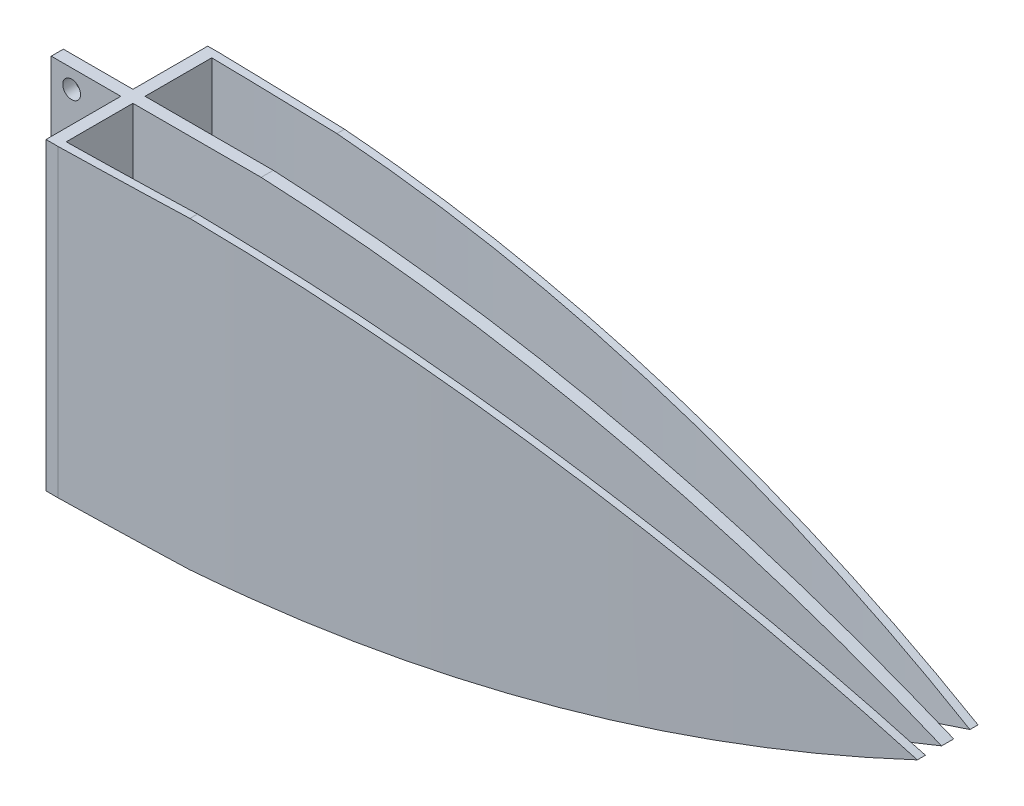
ISO-10303-21;
HEADER;
FILE_DESCRIPTION(('STEP AP214'),'2;1');
FILE_NAME('part.step','',(''),(''),'','','');
FILE_SCHEMA(('AUTOMOTIVE_DESIGN { 1 0 10303 214 1 1 1 1 }'));
ENDSEC;
DATA;
#1=APPLICATION_CONTEXT('core data for automotive mechanical design processes');
#2=APPLICATION_PROTOCOL_DEFINITION('international standard','automotive_design',2000,#1);
#3=PRODUCT_CONTEXT('',#1,'mechanical');
#4=PRODUCT('Part','Part','',(#3));
#5=PRODUCT_RELATED_PRODUCT_CATEGORY('part','',(#4));
#6=PRODUCT_DEFINITION_FORMATION('','',#4);
#7=PRODUCT_DEFINITION_CONTEXT('part definition',#1,'design');
#8=PRODUCT_DEFINITION('design','',#6,#7);
#9=PRODUCT_DEFINITION_SHAPE('','',#8);
#10=(LENGTH_UNIT() NAMED_UNIT(*) SI_UNIT(.MILLI.,.METRE.));
#11=(NAMED_UNIT(*) PLANE_ANGLE_UNIT() SI_UNIT($,.RADIAN.));
#12=(NAMED_UNIT(*) SI_UNIT($,.STERADIAN.) SOLID_ANGLE_UNIT());
#13=UNCERTAINTY_MEASURE_WITH_UNIT(LENGTH_MEASURE(1.E-05),#10,'distance_accuracy_value','');
#14=(GEOMETRIC_REPRESENTATION_CONTEXT(3) GLOBAL_UNCERTAINTY_ASSIGNED_CONTEXT((#13)) GLOBAL_UNIT_ASSIGNED_CONTEXT((#10,
#11,#12)) REPRESENTATION_CONTEXT('',''));
#15=CARTESIAN_POINT('',(0.,0.,0.));
#16=DIRECTION('',(0.,0.,1.));
#17=DIRECTION('',(1.,0.,0.));
#18=AXIS2_PLACEMENT_3D('',#15,#16,#17);
#19=CARTESIAN_POINT('',(-17.2852084932397,-18.2647657841141,-1086.68833589183));
#20=DIRECTION('',(0.,1.,0.));
#21=DIRECTION('',(-1.,0.,0.));
#22=AXIS2_PLACEMENT_3D('',#19,#20,#21);
#23=CYLINDRICAL_SURFACE('',#22,1095.84090006673);
#24=CARTESIAN_POINT('',(13.103688800574,-18.2380913098096,8.73112403222787));
#25=CARTESIAN_POINT('',(14.9986741159179,-18.1821595298657,8.67855571875341));
#26=CARTESIAN_POINT('',(16.8928070961871,-18.104431262455,8.6210855583314));
#27=CARTESIAN_POINT('',(20.6784628465838,-17.9054482740115,8.49640837568931));
#28=CARTESIAN_POINT('',(22.5699856191637,-17.7841935939041,8.42920136262424));
#29=CARTESIAN_POINT('',(28.2389529228422,-17.3552646728917,8.21308781497228));
#30=CARTESIAN_POINT('',(32.0111304158066,-16.9824156790888,8.04967949234752));
#31=CARTESIAN_POINT('',(39.5001416334272,-16.0679334220321,7.68666300479193));
#32=CARTESIAN_POINT('',(43.2171725545415,-15.5277750081056,7.48737729315888));
#33=CARTESIAN_POINT('',(50.6207551394182,-14.2791054574376,7.05286206323423));
#34=CARTESIAN_POINT('',(54.3073068812434,-13.5705947520147,6.817632637031));
#35=CARTESIAN_POINT('',(61.6419552564059,-11.9870546062361,6.31271345795367));
#36=CARTESIAN_POINT('',(65.290053111482,-11.1120304731986,6.04302480349593));
#37=CARTESIAN_POINT('',(72.5402577307319,-9.19763453953254,5.4709418843329));
#38=CARTESIAN_POINT('',(76.1423640874289,-8.15826128388963,5.16854733008348));
#39=CARTESIAN_POINT('',(83.3242254734376,-5.90791883093385,4.5303073083697));
#40=CARTESIAN_POINT('',(86.9035170827257,-4.69554207711856,4.19419492902983));
#41=CARTESIAN_POINT('',(92.2258030985259,-2.75578306800186,3.66839327245229));
#42=CARTESIAN_POINT('',(93.9921713815322,-2.0889776463933,3.48951529583038));
#43=CARTESIAN_POINT('',(97.5085473383613,-0.715332669655094,3.12485754354286));
#44=CARTESIAN_POINT('',(99.258555061766,-0.00849323589739606,2.93907778880211));
#45=CARTESIAN_POINT('',(101.,0.718187038830978,2.74999999999979));
#46=B_SPLINE_CURVE_WITH_KNOTS('',3,(#24,#25,#26,#27,#28,#29,#30,#31,#32,#33,#34,#35,#36,#37,#38,
#39,#40,#41,#42,#43,#44,#45),.UNSPECIFIED.,.F.,.F.,(4,2,2,2,2,2,2,2,2,2,4),(0.,5.6893405528307,
11.3786757563252,22.7563444181236,34.0364425308723,45.3165117443128,56.5962214858857,
67.8760310944907,79.2534859656059,84.942527898806,90.6315525853426),.UNSPECIFIED.);
#47=CARTESIAN_POINT('',(16.7923479325538,-18.1016450332281,8.62257814449768));
#48=VERTEX_POINT('',#47);
#49=CARTESIAN_POINT('',(101.,0.718187038831003,2.74999999999981));
#50=VERTEX_POINT('',#49);
#51=EDGE_CURVE('E325',#48,#50,#46,.T.);
#52=ORIENTED_EDGE('',*,*,#51,.F.);
#53=CARTESIAN_POINT('',(-17.2852084932397,-18.1016450332279,-1086.68833589183));
#54=DIRECTION('',(0.,-1.,0.));
#55=DIRECTION('',(0.,0.,-1.));
#56=AXIS2_PLACEMENT_3D('',#53,#54,#55);
#57=CIRCLE('',#56,1095.84090006673);
#58=CARTESIAN_POINT('',(1.,-18.1016450332281,8.9999999999999));
#59=VERTEX_POINT('',#58);
#60=EDGE_CURVE('E53',#48,#59,#57,.T.);
#61=ORIENTED_EDGE('',*,*,#60,.T.);
#62=DIRECTION('',(0.,1.,0.));
#63=VECTOR('',#62,1.);
#64=CARTESIAN_POINT('',(1.00000000000001,-18.264765784114,9.));
#65=LINE('',#64,#63);
#66=CARTESIAN_POINT('',(1.,19.535234215886,9.));
#67=VERTEX_POINT('',#66);
#68=EDGE_CURVE('E340',#59,#67,#65,.T.);
#69=ORIENTED_EDGE('',*,*,#68,.T.);
#70=CARTESIAN_POINT('',(-17.2852084932397,19.5352342158859,-1086.68833589183));
#71=DIRECTION('',(0.,1.,0.));
#72=DIRECTION('',(-1.,0.,0.));
#73=AXIS2_PLACEMENT_3D('',#70,#71,#72);
#74=CIRCLE('',#73,1095.84090006673);
#75=CARTESIAN_POINT('',(16.8547942960303,19.535234215886,8.6206335175314));
#76=VERTEX_POINT('',#75);
#77=EDGE_CURVE('E252',#67,#76,#74,.T.);
#78=ORIENTED_EDGE('',*,*,#77,.T.);
#79=CARTESIAN_POINT('',(101.,0.718187038831114,2.74999999999981));
#80=CARTESIAN_POINT('',(99.2585550617661,1.44486731355951,2.93907778880233));
#81=CARTESIAN_POINT('',(97.5085473383614,2.15170674731721,3.12485754354307));
#82=CARTESIAN_POINT('',(93.9921713815323,3.52535172405541,3.48951529583042));
#83=CARTESIAN_POINT('',(92.2258030985259,4.19215714566396,3.66839327245217));
#84=CARTESIAN_POINT('',(86.9035170827257,6.13191615478065,4.19419492902944));
#85=CARTESIAN_POINT('',(83.3242254734376,7.34429290859596,4.53030730836937));
#86=CARTESIAN_POINT('',(76.1423640874289,9.59463536155176,5.16854733008339));
#87=CARTESIAN_POINT('',(72.5402577307319,10.6340086171947,5.47094188433297));
#88=CARTESIAN_POINT('',(65.290053111482,12.5484045508607,6.0430248034961));
#89=CARTESIAN_POINT('',(61.6419552564059,13.4234286838981,6.31271345795376));
#90=CARTESIAN_POINT('',(54.3073068812433,15.0069688296768,6.81763263703093));
#91=CARTESIAN_POINT('',(50.6207551394182,15.7154795350997,7.05286206323405));
#92=CARTESIAN_POINT('',(43.2171725545414,16.9641490857678,7.48737729315868));
#93=CARTESIAN_POINT('',(39.5001416334271,17.5043074996942,7.6866630047918));
#94=CARTESIAN_POINT('',(32.0111304158065,18.4187897567509,8.04967949234764));
#95=CARTESIAN_POINT('',(28.2389529228421,18.7916387505538,8.21308781497258));
#96=CARTESIAN_POINT('',(22.5699856191637,19.2205676715662,8.42920136262438));
#97=CARTESIAN_POINT('',(20.6784628465837,19.3418223516736,8.49640837568933));
#98=CARTESIAN_POINT('',(16.892807096187,19.5408053401171,8.62108555833128));
#99=CARTESIAN_POINT('',(14.9986741159178,19.6185336075278,8.67855571875326));
#100=CARTESIAN_POINT('',(13.1036888005739,19.6744653874718,8.73112403222786));
#101=B_SPLINE_CURVE_WITH_KNOTS('',3,(#79,#80,#81,#82,#83,#84,#85,#86,#87,#88,#89,#90,#91,#92,
#93,#94,#95,#96,#97,#98,#99,#100),.UNSPECIFIED.,.F.,.F.,(4,2,2,2,2,2,2,2,2,2,4),(0.,
5.68902468653662,11.3780666197367,22.755521490852,34.0353310994569,45.3150408410299,
56.5951100544705,67.8752081672192,79.2528768290175,84.9422120325121,90.6315525853428),.UNSPECIFIED.);
#102=EDGE_CURVE('E300',#50,#76,#101,.T.);
#103=ORIENTED_EDGE('',*,*,#102,.F.);
#104=EDGE_LOOP('',(#52,#61,#69,#78,#103));
#105=FACE_BOUND('',#104,.T.);
#106=ADVANCED_FACE('F38',(#105),#23,.F.);
#107=CARTESIAN_POINT('',(-25.1770830974539,-18.2647657841141,-1211.95832955926));
#108=DIRECTION('',(0.,1.,0.));
#109=DIRECTION('',(-1.,0.,0.));
#110=AXIS2_PLACEMENT_3D('',#107,#108,#109);
#111=CYLINDRICAL_SURFACE('',#110,1222.23868326066);
#112=DIRECTION('',(0.,-1.,0.));
#113=VECTOR('',#112,1.);
#114=CARTESIAN_POINT('',(1.,19.735234215886,10.));
#115=LINE('',#114,#113);
#116=CARTESIAN_POINT('',(1.,19.535234215886,10.));
#117=VERTEX_POINT('',#116);
#118=CARTESIAN_POINT('',(1.,-18.1016450332281,9.99999999999999));
#119=VERTEX_POINT('',#118);
#120=EDGE_CURVE('E363',#117,#119,#115,.T.);
#121=ORIENTED_EDGE('',*,*,#120,.T.);
#122=CARTESIAN_POINT('',(-25.1770830974539,-18.1016450332279,-1211.95832955926));
#123=DIRECTION('',(0.,-1.,0.));
#124=DIRECTION('',(0.,0.,-1.));
#125=AXIS2_PLACEMENT_3D('',#122,#123,#124);
#126=CIRCLE('',#125,1222.23868326066);
#127=CARTESIAN_POINT('',(16.7923479325538,-18.1016450332281,9.55956458628426));
#128=VERTEX_POINT('',#127);
#129=EDGE_CURVE('E399',#119,#128,#126,.F.);
#130=ORIENTED_EDGE('',*,*,#129,.T.);
#131=CARTESIAN_POINT('',(101.,0.718187038831058,3.74999999999992));
#132=CARTESIAN_POINT('',(99.258003019389,-0.00872359932098572,3.93080120117452));
#133=CARTESIAN_POINT('',(97.507486229986,-0.71576062039269,4.10869942642488));
#134=CARTESIAN_POINT('',(93.990180967723,-2.08974173621458,4.45841038746494));
#135=CARTESIAN_POINT('',(92.2233924532046,-2.75668572828718,4.63022310766929));
#136=CARTESIAN_POINT('',(86.899990629276,-4.69677912966614,5.13609276355491));
#137=CARTESIAN_POINT('',(83.3201386873285,-5.90927440835207,5.46060224289145));
#138=CARTESIAN_POINT('',(76.1372654081746,-8.15978439048723,6.0793080170652));
#139=CARTESIAN_POINT('',(72.5347008550286,-9.19919677168643,6.37373888197213));
#140=CARTESIAN_POINT('',(65.2838916358919,-11.1135622899455,6.93355730676975));
#141=CARTESIAN_POINT('',(61.6356473296942,-11.9885167214772,7.19894509525575));
#142=CARTESIAN_POINT('',(54.3009988799346,-13.571856222557,7.69905892584603));
#143=CARTESIAN_POINT('',(50.6145937080462,-14.2802367911514,7.93378413934783));
#144=CARTESIAN_POINT('',(43.2115237647445,-15.5286354051633,8.37119447025042));
#145=CARTESIAN_POINT('',(39.494858916655,-16.068653023823,8.57387950643676));
#146=CARTESIAN_POINT('',(32.0069914904187,-16.982845824652,8.94770709060366));
#147=CARTESIAN_POINT('',(28.2355946007829,-17.3555580452391,9.11856402722967));
#148=CARTESIAN_POINT('',(22.5678553522702,-17.784335113017,9.34891986239949));
#149=CARTESIAN_POINT('',(20.6767535886379,-17.9055479967174,9.42138609850683));
#150=CARTESIAN_POINT('',(16.891948427009,-18.1044665100688,9.55760639820794));
#151=CARTESIAN_POINT('',(14.9982450268907,-18.1821721042153,9.62136045469202));
#152=CARTESIAN_POINT('',(13.1036888005739,-18.2380913098096,9.68072571101025));
#153=B_SPLINE_CURVE_WITH_KNOTS('',3,(#131,#132,#133,#134,#135,#136,#137,#138,#139,#140,#141,
#142,#143,#144,#145,#146,#147,#148,#149,#150,#151,#152),.UNSPECIFIED.,.F.,.F.,(4,2,2,2,2,2,2,2,
2,2,4),(0.,5.68838999298516,11.3767945532229,22.7529434902618,34.0322328094434,45.3114333440195,
56.5909386162426,67.8704724789469,79.2468027345779,84.9354560007952,90.6241139092895),.UNSPECIFIED.);
#154=CARTESIAN_POINT('',(101.,0.718187038831003,3.7499999999997));
#155=VERTEX_POINT('',#154);
#156=EDGE_CURVE('E317',#155,#128,#153,.T.);
#157=ORIENTED_EDGE('',*,*,#156,.F.);
#158=CARTESIAN_POINT('',(13.1036888005739,19.6744653874718,9.68072571101031));
#159=CARTESIAN_POINT('',(14.9982450268906,19.6185461818774,9.62136045469184));
#160=CARTESIAN_POINT('',(16.891948427009,19.5408405877309,9.55760639820773));
#161=CARTESIAN_POINT('',(20.6767535886378,19.3419220743795,9.4213860985067));
#162=CARTESIAN_POINT('',(22.5678553522702,19.2207091906791,9.34891986239947));
#163=CARTESIAN_POINT('',(28.2355946007828,18.7919321229012,9.11856402722984));
#164=CARTESIAN_POINT('',(32.0069914904186,18.4192199023141,8.94770709060374));
#165=CARTESIAN_POINT('',(39.494858916655,17.5050271014851,8.57387950643675));
#166=CARTESIAN_POINT('',(43.2115237647444,16.9650094828254,8.37119447025044));
#167=CARTESIAN_POINT('',(50.6145937080461,15.7166108688135,7.93378413934786));
#168=CARTESIAN_POINT('',(54.3009988799345,15.0082303002191,7.69905892584604));
#169=CARTESIAN_POINT('',(61.6356473296941,13.4248907991393,7.19894509525575));
#170=CARTESIAN_POINT('',(65.2838916358918,12.5499363676076,6.93355730676975));
#171=CARTESIAN_POINT('',(72.5347008550285,10.6355708493486,6.37373888197212));
#172=CARTESIAN_POINT('',(76.1372654081745,9.59615846814937,6.07930801706518));
#173=CARTESIAN_POINT('',(83.3201386873284,7.34564848601421,5.46060224289142));
#174=CARTESIAN_POINT('',(86.8999906292759,6.13315320732831,5.13609276355489));
#175=CARTESIAN_POINT('',(92.2233924532045,4.19305980594936,4.63022310766926));
#176=CARTESIAN_POINT('',(93.9901809677229,3.52611581387676,4.4584103874649));
#177=CARTESIAN_POINT('',(97.5074862299859,2.15213469805488,4.10869942642484));
#178=CARTESIAN_POINT('',(99.2580030193888,1.44509767698317,3.93080120117448));
#179=CARTESIAN_POINT('',(101.,0.718187038831122,3.74999999999987));
#180=B_SPLINE_CURVE_WITH_KNOTS('',3,(#158,#159,#160,#161,#162,#163,#164,#165,#166,#167,#168,
#169,#170,#171,#172,#173,#174,#175,#176,#177,#178,#179),.UNSPECIFIED.,.F.,.F.,(4,2,2,2,2,2,2,2,
2,2,4),(0.,5.68865790849438,11.3773111747117,22.7536414303427,34.0331752930469,45.31268056527,
56.5918810998461,67.8711704190277,79.2473193560666,84.9357239163043,90.6241139092895),.UNSPECIFIED.);
#181=CARTESIAN_POINT('',(16.854794296037,19.535234215886,9.55741742950722));
#182=VERTEX_POINT('',#181);
#183=EDGE_CURVE('E294',#182,#155,#180,.T.);
#184=ORIENTED_EDGE('',*,*,#183,.F.);
#185=CARTESIAN_POINT('',(-25.1770830974539,19.5352342158859,-1211.95832955926));
#186=DIRECTION('',(0.,1.,0.));
#187=DIRECTION('',(-1.,0.,0.));
#188=AXIS2_PLACEMENT_3D('',#185,#186,#187);
#189=CIRCLE('',#188,1222.23868326066);
#190=EDGE_CURVE('E257',#182,#117,#189,.F.);
#191=ORIENTED_EDGE('',*,*,#190,.T.);
#192=EDGE_LOOP('',(#121,#130,#157,#184,#191));
#193=FACE_BOUND('',#192,.T.);
#194=ADVANCED_FACE('F307',(#193),#111,.T.);
#195=CARTESIAN_POINT('',(-17.2852084932396,-18.2647657841141,1086.68833589183));
#196=DIRECTION('',(0.,1.,0.));
#197=DIRECTION('',(-1.,0.,0.));
#198=AXIS2_PLACEMENT_3D('',#195,#196,#197);
#199=CYLINDRICAL_SURFACE('',#198,1095.84090006673);
#200=DIRECTION('',(0.,1.,0.));
#201=VECTOR('',#200,1.);
#202=CARTESIAN_POINT('',(1.00000000000001,-18.264765784114,-9.));
#203=LINE('',#202,#201);
#204=CARTESIAN_POINT('',(1.,-18.1016450332281,-8.99999999999995));
#205=VERTEX_POINT('',#204);
#206=CARTESIAN_POINT('',(1.00000000000001,19.535234215886,-8.9999999999999));
#207=VERTEX_POINT('',#206);
#208=EDGE_CURVE('E338',#205,#207,#203,.T.);
#209=ORIENTED_EDGE('',*,*,#208,.F.);
#210=CARTESIAN_POINT('',(-17.2852084932396,-18.1016450332283,1086.68833589183));
#211=DIRECTION('',(0.,-1.,0.));
#212=DIRECTION('',(0.,0.,-1.));
#213=AXIS2_PLACEMENT_3D('',#210,#211,#212);
#214=CIRCLE('',#213,1095.84090006673);
#215=CARTESIAN_POINT('',(16.7923479325544,-18.1016450332281,-8.62257814449752));
#216=VERTEX_POINT('',#215);
#217=EDGE_CURVE('E454',#205,#216,#214,.T.);
#218=ORIENTED_EDGE('',*,*,#217,.T.);
#219=CARTESIAN_POINT('',(101.,0.718187038831086,-2.74999999999981));
#220=CARTESIAN_POINT('',(99.2585550617663,-0.00849323589727626,-2.93907778880233));
#221=CARTESIAN_POINT('',(97.5085473383616,-0.715332669654972,-3.12485754354308));
#222=CARTESIAN_POINT('',(93.9921713815325,-2.08897764639318,-3.48951529583042));
#223=CARTESIAN_POINT('',(92.2258030985262,-2.75578306800174,-3.66839327245218));
#224=CARTESIAN_POINT('',(86.9035170827259,-4.69554207711846,-4.19419492902944));
#225=CARTESIAN_POINT('',(83.3242254734378,-5.90791883093376,-4.53030730836938));
#226=CARTESIAN_POINT('',(76.1423640874291,-8.15826128388957,-5.1685473300834));
#227=CARTESIAN_POINT('',(72.5402577307321,-9.1976345395325,-5.47094188433299));
#228=CARTESIAN_POINT('',(65.2900531114822,-11.1120304731985,-6.04302480349611));
#229=CARTESIAN_POINT('',(61.641955256406,-11.987054606236,-6.31271345795378));
#230=CARTESIAN_POINT('',(54.3073068812435,-13.5705947520146,-6.81763263703094));
#231=CARTESIAN_POINT('',(50.6207551394183,-14.2791054574375,-7.05286206323407));
#232=CARTESIAN_POINT('',(43.2171725545415,-15.5277750081056,-7.4873772931587));
#233=CARTESIAN_POINT('',(39.5001416334273,-16.0679334220321,-7.68666300479182));
#234=CARTESIAN_POINT('',(32.0111304158067,-16.9824156790888,-8.04967949234766));
#235=CARTESIAN_POINT('',(28.2389529228423,-17.3552646728917,-8.2130878149726));
#236=CARTESIAN_POINT('',(22.5699856191638,-17.7841935939041,-8.42920136262441));
#237=CARTESIAN_POINT('',(20.6784628465838,-17.9054482740115,-8.49640837568935));
#238=CARTESIAN_POINT('',(16.8928070961871,-18.1044312624549,-8.6210855583313));
#239=CARTESIAN_POINT('',(14.9986741159179,-18.1821595298657,-8.67855571875329));
#240=CARTESIAN_POINT('',(13.103688800574,-18.2380913098097,-8.73112403222789));
#241=B_SPLINE_CURVE_WITH_KNOTS('',3,(#219,#220,#221,#222,#223,#224,#225,#226,#227,#228,#229,
#230,#231,#232,#233,#234,#235,#236,#237,#238,#239,#240),.UNSPECIFIED.,.F.,.F.,(4,2,2,2,2,2,2,2,
2,2,4),(0.,5.68902468653664,11.3780666197367,22.755521490852,34.035331099457,45.31504084103,
56.5951100544706,67.8752081672192,79.2528768290176,84.9422120325122,90.6315525853429),.UNSPECIFIED.);
#242=CARTESIAN_POINT('',(101.,0.718187038831003,-2.75));
#243=VERTEX_POINT('',#242);
#244=EDGE_CURVE('E326',#243,#216,#241,.T.);
#245=ORIENTED_EDGE('',*,*,#244,.F.);
#246=CARTESIAN_POINT('',(13.1036888005739,19.6744653874718,-8.73112403222787));
#247=CARTESIAN_POINT('',(14.9986741159178,19.6185336075278,-8.67855571875326));
#248=CARTESIAN_POINT('',(16.892807096187,19.5408053401171,-8.62108555833127));
#249=CARTESIAN_POINT('',(20.6784628465837,19.3418223516736,-8.49640837568932));
#250=CARTESIAN_POINT('',(22.5699856191637,19.2205676715662,-8.42920136262438));
#251=CARTESIAN_POINT('',(28.2389529228422,18.7916387505538,-8.21308781497258));
#252=CARTESIAN_POINT('',(32.0111304158066,18.4187897567509,-8.04967949234764));
#253=CARTESIAN_POINT('',(39.5001416334271,17.5043074996943,-7.6866630047918));
#254=CARTESIAN_POINT('',(43.2171725545414,16.9641490857678,-7.48737729315867));
#255=CARTESIAN_POINT('',(50.6207551394182,15.7154795350997,-7.05286206323405));
#256=CARTESIAN_POINT('',(54.3073068812434,15.0069688296768,-6.81763263703092));
#257=CARTESIAN_POINT('',(61.6419552564059,13.4234286838982,-6.31271345795376));
#258=CARTESIAN_POINT('',(65.290053111482,12.5484045508607,-6.04302480349609));
#259=CARTESIAN_POINT('',(72.5402577307319,10.6340086171947,-5.47094188433297));
#260=CARTESIAN_POINT('',(76.1423640874289,9.59463536155178,-5.16854733008338));
#261=CARTESIAN_POINT('',(83.3242254734376,7.34429290859598,-4.53030730836936));
#262=CARTESIAN_POINT('',(86.9035170827257,6.13191615478065,-4.19419492902943));
#263=CARTESIAN_POINT('',(92.225803098526,4.19215714566394,-3.66839327245216));
#264=CARTESIAN_POINT('',(93.9921713815323,3.52535172405539,-3.48951529583041));
#265=CARTESIAN_POINT('',(97.5085473383614,2.1517067473172,-3.12485754354306));
#266=CARTESIAN_POINT('',(99.2585550617661,1.44486731355951,-2.93907778880232));
#267=CARTESIAN_POINT('',(101.,0.718187038831127,-2.74999999999979));
#268=B_SPLINE_CURVE_WITH_KNOTS('',3,(#246,#247,#248,#249,#250,#251,#252,#253,#254,#255,#256,
#257,#258,#259,#260,#261,#262,#263,#264,#265,#266,#267),.UNSPECIFIED.,.F.,.F.,(4,2,2,2,2,2,2,2,
2,2,4),(0.,5.68934055283071,11.3786757563253,22.7563444181236,34.0364425308723,45.3165117443128,
56.5962214858858,67.8760310944908,79.2534859656061,84.9425278988062,90.6315525853428),.UNSPECIFIED.);
#269=CARTESIAN_POINT('',(16.854794296037,19.5352342158859,-8.62063351753113));
#270=VERTEX_POINT('',#269);
#271=EDGE_CURVE('E269',#270,#243,#268,.T.);
#272=ORIENTED_EDGE('',*,*,#271,.F.);
#273=CARTESIAN_POINT('',(-17.2852084932397,19.5352342158859,1086.68833589183));
#274=DIRECTION('',(0.,1.,0.));
#275=DIRECTION('',(-1.,0.,0.));
#276=AXIS2_PLACEMENT_3D('',#273,#274,#275);
#277=CIRCLE('',#276,1095.84090006673);
#278=EDGE_CURVE('E61',#270,#207,#277,.T.);
#279=ORIENTED_EDGE('',*,*,#278,.T.);
#280=EDGE_LOOP('',(#209,#218,#245,#272,#279));
#281=FACE_BOUND('',#280,.T.);
#282=ADVANCED_FACE('F310',(#281),#199,.F.);
#283=CARTESIAN_POINT('',(-25.1770830974539,-18.2647657841141,1211.95832955926));
#284=DIRECTION('',(0.,1.,0.));
#285=DIRECTION('',(-1.,0.,0.));
#286=AXIS2_PLACEMENT_3D('',#283,#284,#285);
#287=CYLINDRICAL_SURFACE('',#286,1222.23868326066);
#288=CARTESIAN_POINT('',(13.103688800574,-18.2380913098096,-9.68072571101031));
#289=CARTESIAN_POINT('',(14.9982450268907,-18.1821721042153,-9.62136045469184));
#290=CARTESIAN_POINT('',(16.891948427009,-18.1044665100688,-9.55760639820773));
#291=CARTESIAN_POINT('',(20.6767535886379,-17.9055479967174,-9.4213860985067));
#292=CARTESIAN_POINT('',(22.5678553522702,-17.784335113017,-9.34891986239947));
#293=CARTESIAN_POINT('',(28.2355946007829,-17.3555580452391,-9.11856402722984));
#294=CARTESIAN_POINT('',(32.0069914904186,-16.982845824652,-8.94770709060374));
#295=CARTESIAN_POINT('',(39.494858916655,-16.068653023823,-8.57387950643675));
#296=CARTESIAN_POINT('',(43.2115237647445,-15.5286354051633,-8.37119447025043));
#297=CARTESIAN_POINT('',(50.6145937080462,-14.2802367911514,-7.93378413934785));
#298=CARTESIAN_POINT('',(54.3009988799346,-13.5718562225569,-7.69905892584604));
#299=CARTESIAN_POINT('',(61.6356473296941,-11.9885167214772,-7.19894509525575));
#300=CARTESIAN_POINT('',(65.2838916358919,-11.1135622899455,-6.93355730676975));
#301=CARTESIAN_POINT('',(72.5347008550286,-9.19919677168648,-6.37373888197211));
#302=CARTESIAN_POINT('',(76.1372654081746,-8.15978439048728,-6.07930801706518));
#303=CARTESIAN_POINT('',(83.3201386873285,-5.90927440835208,-5.46060224289142));
#304=CARTESIAN_POINT('',(86.8999906292759,-4.69677912966613,-5.13609276355488));
#305=CARTESIAN_POINT('',(92.2233924532045,-2.75668572828721,-4.63022310766925));
#306=CARTESIAN_POINT('',(93.9901809677229,-2.08974173621464,-4.4584103874649));
#307=CARTESIAN_POINT('',(97.507486229986,-0.715760620392782,-4.10869942642483));
#308=CARTESIAN_POINT('',(99.2580030193889,-0.00872359932107549,-3.93080120117447));
#309=CARTESIAN_POINT('',(101.,0.718187038831019,-3.74999999999987));
#310=B_SPLINE_CURVE_WITH_KNOTS('',3,(#288,#289,#290,#291,#292,#293,#294,#295,#296,#297,#298,
#299,#300,#301,#302,#303,#304,#305,#306,#307,#308,#309),.UNSPECIFIED.,.F.,.F.,(4,2,2,2,2,2,2,2,
2,2,4),(0.,5.68865790849438,11.3773111747116,22.7536414303426,34.0331752930469,45.31268056527,
56.5918810998461,67.8711704190276,79.2473193560665,84.9357239163043,90.6241139092894),.UNSPECIFIED.);
#311=CARTESIAN_POINT('',(16.7923479325538,-18.1016450332281,-9.55956458628426));
#312=VERTEX_POINT('',#311);
#313=CARTESIAN_POINT('',(101.,0.718187038831003,-3.7499999999997));
#314=VERTEX_POINT('',#313);
#315=EDGE_CURVE('E413',#312,#314,#310,.T.);
#316=ORIENTED_EDGE('',*,*,#315,.F.);
#317=CARTESIAN_POINT('',(-25.1770830974539,-18.1016450332283,1211.95832955926));
#318=DIRECTION('',(0.,-1.,0.));
#319=DIRECTION('',(0.,0.,-1.));
#320=AXIS2_PLACEMENT_3D('',#317,#318,#319);
#321=CIRCLE('',#320,1222.23868326066);
#322=CARTESIAN_POINT('',(0.99999999999989,-18.1016450332281,-9.99999999999979));
#323=VERTEX_POINT('',#322);
#324=EDGE_CURVE('E448',#312,#323,#321,.F.);
#325=ORIENTED_EDGE('',*,*,#324,.T.);
#326=DIRECTION('',(0.,1.,0.));
#327=VECTOR('',#326,1.);
#328=CARTESIAN_POINT('',(0.999999999999795,-18.264765784114,-9.99999999999979));
#329=LINE('',#328,#327);
#330=CARTESIAN_POINT('',(0.999999999999789,19.535234215886,-9.99999999999979));
#331=VERTEX_POINT('',#330);
#332=EDGE_CURVE('E337',#323,#331,#329,.T.);
#333=ORIENTED_EDGE('',*,*,#332,.T.);
#334=CARTESIAN_POINT('',(-25.1770830974539,19.5352342158859,1211.95832955926));
#335=DIRECTION('',(0.,1.,0.));
#336=DIRECTION('',(-1.,0.,0.));
#337=AXIS2_PLACEMENT_3D('',#334,#335,#336);
#338=CIRCLE('',#337,1222.23868326066);
#339=CARTESIAN_POINT('',(16.854794296037,19.535234215886,-9.55741742950722));
#340=VERTEX_POINT('',#339);
#341=EDGE_CURVE('E221',#331,#340,#338,.F.);
#342=ORIENTED_EDGE('',*,*,#341,.T.);
#343=CARTESIAN_POINT('',(101.,0.718187038831114,-3.7499999999997));
#344=CARTESIAN_POINT('',(99.2580030193889,1.44509767698317,-3.93080120117444));
#345=CARTESIAN_POINT('',(97.5074862299859,2.15213469805488,-4.10869942642482));
#346=CARTESIAN_POINT('',(93.9901809677229,3.52611581387677,-4.45841038746483));
#347=CARTESIAN_POINT('',(92.2233924532045,4.19305980594937,-4.63022310766912));
#348=CARTESIAN_POINT('',(86.8999906292759,6.13315320732832,-5.13609276355475));
#349=CARTESIAN_POINT('',(83.3201386873285,7.34564848601421,-5.46060224289155));
#350=CARTESIAN_POINT('',(76.1372654081745,9.59615846814937,-6.07930801706531));
#351=CARTESIAN_POINT('',(72.5347008550285,10.6355708493486,-6.37373888197199));
#352=CARTESIAN_POINT('',(65.2838916358918,12.5499363676076,-6.93355730676953));
#353=CARTESIAN_POINT('',(61.6356473296941,13.4248907991393,-7.19894509525569));
#354=CARTESIAN_POINT('',(54.3009988799345,15.0082303002191,-7.69905892584608));
#355=CARTESIAN_POINT('',(50.6145937080461,15.7166108688135,-7.93378413934783));
#356=CARTESIAN_POINT('',(43.2115237647444,16.9650094828254,-8.37119447025045));
#357=CARTESIAN_POINT('',(39.494858916655,17.5050271014851,-8.57387950643687));
#358=CARTESIAN_POINT('',(32.0069914904186,18.4192199023141,-8.94770709060376));
#359=CARTESIAN_POINT('',(28.2355946007829,18.7919321229012,-9.11856402722966));
#360=CARTESIAN_POINT('',(22.5678553522702,19.2207091906791,-9.34891986239943));
#361=CARTESIAN_POINT('',(20.6767535886379,19.3419220743795,-9.42138609850677));
#362=CARTESIAN_POINT('',(16.891948427009,19.5408405877309,-9.55760639820795));
#363=CARTESIAN_POINT('',(14.9982450268906,19.6185461818774,-9.62136045469209));
#364=CARTESIAN_POINT('',(13.1036888005739,19.6744653874718,-9.68072571101045));
#365=B_SPLINE_CURVE_WITH_KNOTS('',3,(#343,#344,#345,#346,#347,#348,#349,#350,#351,#352,#353,
#354,#355,#356,#357,#358,#359,#360,#361,#362,#363,#364),.UNSPECIFIED.,.F.,.F.,(4,2,2,2,2,2,2,2,
2,2,4),(0.,5.68838999298517,11.3767945532229,22.7529434902618,34.0322328094434,45.3114333440195,
56.5909386162425,67.8704724789468,79.2468027345778,84.9354560007951,90.6241139092894),.UNSPECIFIED.);
#366=EDGE_CURVE('E260',#314,#340,#365,.T.);
#367=ORIENTED_EDGE('',*,*,#366,.F.);
#368=EDGE_LOOP('',(#316,#325,#333,#342,#367));
#369=FACE_BOUND('',#368,.T.);
#370=ADVANCED_FACE('F276',(#369),#287,.T.);
#371=CARTESIAN_POINT('',(0.,0.,-0.75));
#372=DIRECTION('',(0.,0.,1.));
#373=DIRECTION('',(1.,0.,0.));
#374=AXIS2_PLACEMENT_3D('',#371,#372,#373);
#375=PLANE('',#374);
#376=CARTESIAN_POINT('',(-6.60183299389003,-15.7647657841141,-0.75));
#377=DIRECTION('',(0.,0.,1.));
#378=DIRECTION('',(1.,0.,0.));
#379=AXIS2_PLACEMENT_3D('',#376,#377,#378);
#380=CIRCLE('',#379,1.1);
#381=CARTESIAN_POINT('',(-5.50183299389003,-15.7647657841141,-0.75));
#382=VERTEX_POINT('',#381);
#383=EDGE_CURVE('E384',#382,#382,#380,.T.);
#384=ORIENTED_EDGE('',*,*,#383,.T.);
#385=EDGE_LOOP('',(#384));
#386=FACE_BOUND('',#385,.T.);
#387=CARTESIAN_POINT('',(-6.57841140529532,17.2352342158859,-0.75));
#388=DIRECTION('',(0.,0.,1.));
#389=DIRECTION('',(1.,0.,0.));
#390=AXIS2_PLACEMENT_3D('',#387,#388,#389);
#391=CIRCLE('',#390,1.1);
#392=CARTESIAN_POINT('',(-5.47841140529532,17.2352342158859,-0.75));
#393=VERTEX_POINT('',#392);
#394=EDGE_CURVE('E381',#393,#393,#391,.T.);
#395=ORIENTED_EDGE('',*,*,#394,.T.);
#396=EDGE_LOOP('',(#395));
#397=FACE_BOUND('',#396,.T.);
#398=DIRECTION('',(0.,1.,0.));
#399=VECTOR('',#398,1.);
#400=CARTESIAN_POINT('',(-0.716018878796458,0.,-0.75));
#401=LINE('',#400,#399);
#402=CARTESIAN_POINT('',(-0.716018878796458,-18.2647657841141,-0.75));
#403=VERTEX_POINT('',#402);
#404=CARTESIAN_POINT('',(-0.716018878796458,-18.1016450332281,-0.750000000000001));
#405=VERTEX_POINT('',#404);
#406=EDGE_CURVE('E208',#403,#405,#401,.T.);
#407=ORIENTED_EDGE('',*,*,#406,.F.);
#408=DIRECTION('',(1.,0.,0.));
#409=VECTOR('',#408,1.);
#410=CARTESIAN_POINT('',(-9.10183299389003,-18.2647657841141,-0.75));
#411=LINE('',#410,#409);
#412=CARTESIAN_POINT('',(-9.10183299389003,-18.2647657841141,-0.75));
#413=VERTEX_POINT('',#412);
#414=EDGE_CURVE('E389',#413,#403,#411,.T.);
#415=ORIENTED_EDGE('',*,*,#414,.F.);
#416=DIRECTION('',(0.,-1.,0.));
#417=VECTOR('',#416,1.);
#418=CARTESIAN_POINT('',(-9.10183299389003,19.7352342158859,-0.75));
#419=LINE('',#418,#417);
#420=CARTESIAN_POINT('',(-9.10183299389003,19.5352342158859,-0.75));
#421=VERTEX_POINT('',#420);
#422=EDGE_CURVE('E387',#421,#413,#419,.T.);
#423=ORIENTED_EDGE('',*,*,#422,.F.);
#424=DIRECTION('',(-1.,0.,0.));
#425=VECTOR('',#424,1.);
#426=CARTESIAN_POINT('',(0.,19.535234215886,-0.75));
#427=LINE('',#426,#425);
#428=CARTESIAN_POINT('',(-0.5,19.535234215886,-0.75));
#429=VERTEX_POINT('',#428);
#430=EDGE_CURVE('E235',#429,#421,#427,.T.);
#431=ORIENTED_EDGE('',*,*,#430,.F.);
#432=DIRECTION('',(0.,1.,0.));
#433=VECTOR('',#432,1.);
#434=CARTESIAN_POINT('',(-0.5,0.,-0.75));
#435=LINE('',#434,#433);
#436=CARTESIAN_POINT('',(-0.5,-18.1016450332281,-0.75));
#437=VERTEX_POINT('',#436);
#438=EDGE_CURVE('E366',#437,#429,#435,.T.);
#439=ORIENTED_EDGE('',*,*,#438,.F.);
#440=DIRECTION('',(1.,0.,0.));
#441=VECTOR('',#440,1.);
#442=CARTESIAN_POINT('',(0.,-18.1016450332281,-0.75));
#443=LINE('',#442,#441);
#444=EDGE_CURVE('E441',#405,#437,#443,.T.);
#445=ORIENTED_EDGE('',*,*,#444,.F.);
#446=EDGE_LOOP('',(#407,#415,#423,#431,#439,#445));
#447=FACE_BOUND('',#446,.T.);
#448=ADVANCED_FACE('F495',(#386,#397,#447),#375,.F.);
#449=CARTESIAN_POINT('',(0.,0.,0.75));
#450=DIRECTION('',(0.,0.,1.));
#451=DIRECTION('',(1.,0.,0.));
#452=AXIS2_PLACEMENT_3D('',#449,#450,#451);
#453=PLANE('',#452);
#454=CARTESIAN_POINT('',(-6.60183299389003,-15.7647657841141,0.75));
#455=DIRECTION('',(0.,0.,1.));
#456=DIRECTION('',(1.,0.,0.));
#457=AXIS2_PLACEMENT_3D('',#454,#455,#456);
#458=CIRCLE('',#457,1.1);
#459=CARTESIAN_POINT('',(-5.50183299389003,-15.7647657841141,0.75));
#460=VERTEX_POINT('',#459);
#461=EDGE_CURVE('E375',#460,#460,#458,.T.);
#462=ORIENTED_EDGE('',*,*,#461,.F.);
#463=EDGE_LOOP('',(#462));
#464=FACE_BOUND('',#463,.T.);
#465=CARTESIAN_POINT('',(-6.57841140529532,17.2352342158859,0.75));
#466=DIRECTION('',(0.,0.,1.));
#467=DIRECTION('',(1.,0.,0.));
#468=AXIS2_PLACEMENT_3D('',#465,#466,#467);
#469=CIRCLE('',#468,1.1);
#470=CARTESIAN_POINT('',(-5.47841140529532,17.2352342158859,0.75));
#471=VERTEX_POINT('',#470);
#472=EDGE_CURVE('E372',#471,#471,#469,.T.);
#473=ORIENTED_EDGE('',*,*,#472,.F.);
#474=EDGE_LOOP('',(#473));
#475=FACE_BOUND('',#474,.T.);
#476=DIRECTION('',(1.,0.,0.));
#477=VECTOR('',#476,1.);
#478=CARTESIAN_POINT('',(-9.10183299389003,-18.2647657841141,0.75));
#479=LINE('',#478,#477);
#480=CARTESIAN_POINT('',(-9.10183299389003,-18.2647657841141,0.75));
#481=VERTEX_POINT('',#480);
#482=CARTESIAN_POINT('',(-0.716018878796458,-18.2647657841141,0.75));
#483=VERTEX_POINT('',#482);
#484=EDGE_CURVE('E214',#481,#483,#479,.T.);
#485=ORIENTED_EDGE('',*,*,#484,.T.);
#486=DIRECTION('',(0.,1.,0.));
#487=VECTOR('',#486,1.);
#488=CARTESIAN_POINT('',(-0.716018878796458,0.,0.75));
#489=LINE('',#488,#487);
#490=CARTESIAN_POINT('',(-0.716018878796458,-18.1016450332281,0.750000000000001));
#491=VERTEX_POINT('',#490);
#492=EDGE_CURVE('E203',#483,#491,#489,.T.);
#493=ORIENTED_EDGE('',*,*,#492,.T.);
#494=DIRECTION('',(1.,0.,0.));
#495=VECTOR('',#494,1.);
#496=CARTESIAN_POINT('',(0.,-18.1016450332281,0.75));
#497=LINE('',#496,#495);
#498=CARTESIAN_POINT('',(-0.5,-18.1016450332281,0.75));
#499=VERTEX_POINT('',#498);
#500=EDGE_CURVE('E193',#491,#499,#497,.T.);
#501=ORIENTED_EDGE('',*,*,#500,.T.);
#502=DIRECTION('',(0.,1.,0.));
#503=VECTOR('',#502,1.);
#504=CARTESIAN_POINT('',(-0.5,0.,0.75));
#505=LINE('',#504,#503);
#506=CARTESIAN_POINT('',(-0.5,19.535234215886,0.75));
#507=VERTEX_POINT('',#506);
#508=EDGE_CURVE('E395',#499,#507,#505,.T.);
#509=ORIENTED_EDGE('',*,*,#508,.T.);
#510=DIRECTION('',(-1.,0.,0.));
#511=VECTOR('',#510,1.);
#512=CARTESIAN_POINT('',(0.,19.535234215886,0.75));
#513=LINE('',#512,#511);
#514=CARTESIAN_POINT('',(-9.10183299389003,19.5352342158859,0.75));
#515=VERTEX_POINT('',#514);
#516=EDGE_CURVE('E247',#507,#515,#513,.T.);
#517=ORIENTED_EDGE('',*,*,#516,.T.);
#518=DIRECTION('',(0.,-1.,0.));
#519=VECTOR('',#518,1.);
#520=CARTESIAN_POINT('',(-9.10183299389003,19.7352342158859,0.75));
#521=LINE('',#520,#519);
#522=EDGE_CURVE('E378',#515,#481,#521,.T.);
#523=ORIENTED_EDGE('',*,*,#522,.T.);
#524=EDGE_LOOP('',(#485,#493,#501,#509,#517,#523));
#525=FACE_BOUND('',#524,.T.);
#526=ADVANCED_FACE('F212',(#464,#475,#525),#453,.T.);
#527=CARTESIAN_POINT('',(-0.5,0.,0.));
#528=DIRECTION('',(1.,0.,0.));
#529=DIRECTION('',(0.,0.,-1.));
#530=AXIS2_PLACEMENT_3D('',#527,#528,#529);
#531=PLANE('',#530);
#532=DIRECTION('',(0.,0.,-1.));
#533=VECTOR('',#532,1.);
#534=CARTESIAN_POINT('',(-0.5,-18.1016450332281,0.));
#535=LINE('',#534,#533);
#536=CARTESIAN_POINT('',(-0.5,-18.1016450332281,9.99999999999999));
#537=VERTEX_POINT('',#536);
#538=EDGE_CURVE('E199',#537,#499,#535,.T.);
#539=ORIENTED_EDGE('',*,*,#538,.F.);
#540=DIRECTION('',(0.,-1.,0.));
#541=VECTOR('',#540,1.);
#542=CARTESIAN_POINT('',(-0.5,19.735234215886,10.));
#543=LINE('',#542,#541);
#544=CARTESIAN_POINT('',(-0.5,19.535234215886,10.));
#545=VERTEX_POINT('',#544);
#546=EDGE_CURVE('E362',#545,#537,#543,.T.);
#547=ORIENTED_EDGE('',*,*,#546,.F.);
#548=DIRECTION('',(0.,0.,1.));
#549=VECTOR('',#548,1.);
#550=CARTESIAN_POINT('',(-0.5,19.535234215886,0.));
#551=LINE('',#550,#549);
#552=EDGE_CURVE('E236',#507,#545,#551,.T.);
#553=ORIENTED_EDGE('',*,*,#552,.F.);
#554=ORIENTED_EDGE('',*,*,#508,.F.);
#555=EDGE_LOOP('',(#539,#547,#553,#554));
#556=FACE_BOUND('',#555,.T.);
#557=ADVANCED_FACE('F440',(#556),#531,.F.);
#558=CARTESIAN_POINT('',(-0.5,-18.1016450332281,-10.));
#559=VERTEX_POINT('',#558);
#560=EDGE_CURVE('E443',#437,#559,#535,.T.);
#561=ORIENTED_EDGE('',*,*,#560,.F.);
#562=ORIENTED_EDGE('',*,*,#438,.T.);
#563=CARTESIAN_POINT('',(-0.5,19.535234215886,-10.));
#564=VERTEX_POINT('',#563);
#565=EDGE_CURVE('E232',#564,#429,#551,.T.);
#566=ORIENTED_EDGE('',*,*,#565,.F.);
#567=DIRECTION('',(0.,1.,0.));
#568=VECTOR('',#567,1.);
#569=CARTESIAN_POINT('',(-0.5,19.735234215886,-10.));
#570=LINE('',#569,#568);
#571=EDGE_CURVE('E367',#559,#564,#570,.T.);
#572=ORIENTED_EDGE('',*,*,#571,.F.);
#573=EDGE_LOOP('',(#561,#562,#566,#572));
#574=FACE_BOUND('',#573,.T.);
#575=ADVANCED_FACE('F490',(#574),#531,.F.);
#576=CARTESIAN_POINT('',(1.,19.735234215886,10.));
#577=DIRECTION('',(0.,0.,-1.));
#578=DIRECTION('',(0.,1.,0.));
#579=AXIS2_PLACEMENT_3D('',#576,#577,#578);
#580=PLANE('',#579);
#581=DIRECTION('',(-1.,0.,0.));
#582=VECTOR('',#581,1.);
#583=CARTESIAN_POINT('',(-0.716018878796458,-18.1016450332281,9.99999999999999));
#584=LINE('',#583,#582);
#585=EDGE_CURVE('E209',#119,#537,#584,.T.);
#586=ORIENTED_EDGE('',*,*,#585,.F.);
#587=ORIENTED_EDGE('',*,*,#120,.F.);
#588=DIRECTION('',(1.,0.,0.));
#589=VECTOR('',#588,1.);
#590=CARTESIAN_POINT('',(-9.75415814699477,19.5352342158859,10.));
#591=LINE('',#590,#589);
#592=EDGE_CURVE('E216',#545,#117,#591,.T.);
#593=ORIENTED_EDGE('',*,*,#592,.F.);
#594=ORIENTED_EDGE('',*,*,#546,.T.);
#595=EDGE_LOOP('',(#586,#587,#593,#594));
#596=FACE_BOUND('',#595,.T.);
#597=ADVANCED_FACE('F439',(#596),#580,.F.);
#598=CARTESIAN_POINT('',(1.,19.735234215886,-10.));
#599=DIRECTION('',(0.,0.,1.));
#600=DIRECTION('',(0.,-1.,0.));
#601=AXIS2_PLACEMENT_3D('',#598,#599,#600);
#602=PLANE('',#601);
#603=DIRECTION('',(1.,0.,0.));
#604=VECTOR('',#603,1.);
#605=CARTESIAN_POINT('',(1.,-18.1016450332281,-10.));
#606=LINE('',#605,#604);
#607=EDGE_CURVE('E445',#559,#323,#606,.T.);
#608=ORIENTED_EDGE('',*,*,#607,.F.);
#609=ORIENTED_EDGE('',*,*,#571,.T.);
#610=DIRECTION('',(-1.,0.,0.));
#611=VECTOR('',#610,1.);
#612=CARTESIAN_POINT('',(1.,19.535234215886,-10.));
#613=LINE('',#612,#611);
#614=EDGE_CURVE('E228',#331,#564,#613,.T.);
#615=ORIENTED_EDGE('',*,*,#614,.F.);
#616=ORIENTED_EDGE('',*,*,#332,.F.);
#617=EDGE_LOOP('',(#608,#609,#615,#616));
#618=FACE_BOUND('',#617,.T.);
#619=ADVANCED_FACE('F487',(#618),#602,.F.);
#620=CARTESIAN_POINT('',(1.,0.,0.));
#621=DIRECTION('',(1.,0.,0.));
#622=DIRECTION('',(0.,0.,-1.));
#623=AXIS2_PLACEMENT_3D('',#620,#621,#622);
#624=PLANE('',#623);
#625=ORIENTED_EDGE('',*,*,#68,.F.);
#626=DIRECTION('',(0.,0.,-1.));
#627=VECTOR('',#626,1.);
#628=CARTESIAN_POINT('',(1.,-18.1016450332281,0.));
#629=LINE('',#628,#627);
#630=CARTESIAN_POINT('',(1.,-18.1016450332281,0.75));
#631=VERTEX_POINT('',#630);
#632=EDGE_CURVE('E466',#59,#631,#629,.T.);
#633=ORIENTED_EDGE('',*,*,#632,.T.);
#634=DIRECTION('',(0.,-1.,0.));
#635=VECTOR('',#634,1.);
#636=CARTESIAN_POINT('',(1.,19.735234215886,0.75));
#637=LINE('',#636,#635);
#638=CARTESIAN_POINT('',(1.,19.535234215886,0.75));
#639=VERTEX_POINT('',#638);
#640=EDGE_CURVE('E346',#639,#631,#637,.T.);
#641=ORIENTED_EDGE('',*,*,#640,.F.);
#642=DIRECTION('',(0.,0.,1.));
#643=VECTOR('',#642,1.);
#644=CARTESIAN_POINT('',(1.,19.535234215886,0.));
#645=LINE('',#644,#643);
#646=EDGE_CURVE('E229',#639,#67,#645,.T.);
#647=ORIENTED_EDGE('',*,*,#646,.T.);
#648=EDGE_LOOP('',(#625,#633,#641,#647));
#649=FACE_BOUND('',#648,.T.);
#650=ADVANCED_FACE('F431',(#649),#624,.T.);
#651=DIRECTION('',(0.,-1.,0.));
#652=VECTOR('',#651,1.);
#653=CARTESIAN_POINT('',(1.,19.735234215886,-0.75));
#654=LINE('',#653,#652);
#655=CARTESIAN_POINT('',(1.,19.535234215886,-0.75));
#656=VERTEX_POINT('',#655);
#657=CARTESIAN_POINT('',(1.,-18.1016450332281,-0.75));
#658=VERTEX_POINT('',#657);
#659=EDGE_CURVE('E354',#656,#658,#654,.T.);
#660=ORIENTED_EDGE('',*,*,#659,.T.);
#661=EDGE_CURVE('E457',#658,#205,#629,.T.);
#662=ORIENTED_EDGE('',*,*,#661,.T.);
#663=ORIENTED_EDGE('',*,*,#208,.T.);
#664=EDGE_CURVE('E225',#207,#656,#645,.T.);
#665=ORIENTED_EDGE('',*,*,#664,.T.);
#666=EDGE_LOOP('',(#660,#662,#663,#665));
#667=FACE_BOUND('',#666,.T.);
#668=ADVANCED_FACE('F472',(#667),#624,.T.);
#669=CARTESIAN_POINT('',(5.81122986513974,-227.395722099122,-0.75));
#670=DIRECTION('',(0.,0.,-1.));
#671=DIRECTION('',(-1.,0.,0.));
#672=AXIS2_PLACEMENT_3D('',#669,#670,#671);
#673=PLANE('',#672);
#674=CARTESIAN_POINT('',(5.81122986513974,228.832096176784,-0.75));
#675=DIRECTION('',(0.,0.,1.));
#676=DIRECTION('',(1.,0.,0.));
#677=AXIS2_PLACEMENT_3D('',#674,#675,#676);
#678=CIRCLE('',#677,247.177785211344);
#679=CARTESIAN_POINT('',(16.7923479326363,-18.1016450332281,-0.75));
#680=VERTEX_POINT('',#679);
#681=CARTESIAN_POINT('',(101.,0.718187038831003,-0.75));
#682=VERTEX_POINT('',#681);
#683=EDGE_CURVE('E357',#680,#682,#678,.T.);
#684=ORIENTED_EDGE('',*,*,#683,.F.);
#685=DIRECTION('',(-1.,0.,0.));
#686=VECTOR('',#685,1.);
#687=CARTESIAN_POINT('',(5.81122986513974,-18.1016450332281,-0.75));
#688=LINE('',#687,#686);
#689=EDGE_CURVE('E458',#680,#658,#688,.T.);
#690=ORIENTED_EDGE('',*,*,#689,.T.);
#691=ORIENTED_EDGE('',*,*,#659,.F.);
#692=DIRECTION('',(1.,0.,0.));
#693=VECTOR('',#692,1.);
#694=CARTESIAN_POINT('',(5.81122986513966,19.535234215886,-0.75));
#695=LINE('',#694,#693);
#696=CARTESIAN_POINT('',(16.8547942961207,19.535234215886,-0.75));
#697=VERTEX_POINT('',#696);
#698=EDGE_CURVE('E238',#656,#697,#695,.T.);
#699=ORIENTED_EDGE('',*,*,#698,.T.);
#700=CARTESIAN_POINT('',(5.81122986513974,-227.395722099122,-0.75));
#701=DIRECTION('',(0.,0.,1.));
#702=DIRECTION('',(-1.,0.,0.));
#703=AXIS2_PLACEMENT_3D('',#700,#701,#702);
#704=CIRCLE('',#703,247.177785211344);
#705=EDGE_CURVE('E351',#682,#697,#704,.T.);
#706=ORIENTED_EDGE('',*,*,#705,.F.);
#707=EDGE_LOOP('',(#684,#690,#691,#699,#706));
#708=FACE_BOUND('',#707,.T.);
#709=ADVANCED_FACE('F511',(#708),#673,.T.);
#710=CARTESIAN_POINT('',(5.81122986513974,-227.395722099122,0.75));
#711=DIRECTION('',(0.,0.,-1.));
#712=DIRECTION('',(-1.,0.,0.));
#713=AXIS2_PLACEMENT_3D('',#710,#711,#712);
#714=PLANE('',#713);
#715=DIRECTION('',(-1.,0.,0.));
#716=VECTOR('',#715,1.);
#717=CARTESIAN_POINT('',(5.81122986513974,-18.1016450332281,0.75));
#718=LINE('',#717,#716);
#719=CARTESIAN_POINT('',(16.7923479326363,-18.1016450332281,0.75));
#720=VERTEX_POINT('',#719);
#721=EDGE_CURVE('E464',#720,#631,#718,.T.);
#722=ORIENTED_EDGE('',*,*,#721,.F.);
#723=CARTESIAN_POINT('',(5.81122986513974,228.832096176784,0.75));
#724=DIRECTION('',(0.,0.,1.));
#725=DIRECTION('',(1.,0.,0.));
#726=AXIS2_PLACEMENT_3D('',#723,#724,#725);
#727=CIRCLE('',#726,247.177785211344);
#728=CARTESIAN_POINT('',(101.,0.718187038831003,0.75));
#729=VERTEX_POINT('',#728);
#730=EDGE_CURVE('E349',#720,#729,#727,.T.);
#731=ORIENTED_EDGE('',*,*,#730,.T.);
#732=CARTESIAN_POINT('',(5.81122986513974,-227.395722099122,0.75));
#733=DIRECTION('',(0.,0.,1.));
#734=DIRECTION('',(-1.,0.,0.));
#735=AXIS2_PLACEMENT_3D('',#732,#733,#734);
#736=CIRCLE('',#735,247.177785211344);
#737=CARTESIAN_POINT('',(16.8547942961207,19.535234215886,0.75));
#738=VERTEX_POINT('',#737);
#739=EDGE_CURVE('E343',#729,#738,#736,.T.);
#740=ORIENTED_EDGE('',*,*,#739,.T.);
#741=DIRECTION('',(1.,0.,0.));
#742=VECTOR('',#741,1.);
#743=CARTESIAN_POINT('',(5.81122986513966,19.535234215886,0.75));
#744=LINE('',#743,#742);
#745=EDGE_CURVE('E250',#639,#738,#744,.T.);
#746=ORIENTED_EDGE('',*,*,#745,.F.);
#747=ORIENTED_EDGE('',*,*,#640,.T.);
#748=EDGE_LOOP('',(#722,#731,#740,#746,#747));
#749=FACE_BOUND('',#748,.T.);
#750=ADVANCED_FACE('F504',(#749),#714,.F.);
#751=CARTESIAN_POINT('',(-9.10183299389003,-18.2647657841141,-0.75));
#752=DIRECTION('',(0.,-1.,0.));
#753=DIRECTION('',(0.,0.,-1.));
#754=AXIS2_PLACEMENT_3D('',#751,#752,#753);
#755=PLANE('',#754);
#756=ORIENTED_EDGE('',*,*,#414,.T.);
#757=DIRECTION('',(0.,0.,1.));
#758=VECTOR('',#757,1.);
#759=CARTESIAN_POINT('',(-0.716018878796458,-18.2647657841141,-0.75));
#760=LINE('',#759,#758);
#761=EDGE_CURVE('E11',#403,#483,#760,.T.);
#762=ORIENTED_EDGE('',*,*,#761,.T.);
#763=ORIENTED_EDGE('',*,*,#484,.F.);
#764=DIRECTION('',(0.,0.,1.));
#765=VECTOR('',#764,1.);
#766=CARTESIAN_POINT('',(-9.10183299389003,-18.2647657841141,-0.75));
#767=LINE('',#766,#765);
#768=EDGE_CURVE('E392',#413,#481,#767,.T.);
#769=ORIENTED_EDGE('',*,*,#768,.F.);
#770=EDGE_LOOP('',(#756,#762,#763,#769));
#771=FACE_BOUND('',#770,.T.);
#772=ADVANCED_FACE('F501',(#771),#755,.T.);
#773=CARTESIAN_POINT('',(5.81122986513974,228.832096176784,-0.75));
#774=DIRECTION('',(0.,0.,1.));
#775=DIRECTION('',(1.,0.,0.));
#776=AXIS2_PLACEMENT_3D('',#773,#774,#775);
#777=CYLINDRICAL_SURFACE('',#776,247.177785211344);
#778=ORIENTED_EDGE('',*,*,#730,.F.);
#779=DIRECTION('',(0.,0.,1.));
#780=VECTOR('',#779,1.);
#781=CARTESIAN_POINT('',(16.7923479326363,-18.1016450332281,-0.75000000000004));
#782=LINE('',#781,#780);
#783=EDGE_CURVE('E461',#720,#680,#782,.F.);
#784=ORIENTED_EDGE('',*,*,#783,.T.);
#785=ORIENTED_EDGE('',*,*,#683,.T.);
#786=DIRECTION('',(0.,0.,1.));
#787=VECTOR('',#786,1.);
#788=CARTESIAN_POINT('',(101.,0.718187038831003,-0.75));
#789=LINE('',#788,#787);
#790=EDGE_CURVE('E359',#682,#729,#789,.T.);
#791=ORIENTED_EDGE('',*,*,#790,.T.);
#792=EDGE_LOOP('',(#778,#784,#785,#791));
#793=FACE_BOUND('',#792,.T.);
#794=ADVANCED_FACE('F503',(#793),#777,.T.);
#795=CARTESIAN_POINT('',(5.81122986484431,228.832096178153,20.));
#796=DIRECTION('',(0.,0.,-1.));
#797=DIRECTION('',(-1.,0.,0.));
#798=AXIS2_PLACEMENT_3D('',#795,#796,#797);
#799=CYLINDRICAL_SURFACE('',#798,247.177785212722);
#800=DIRECTION('',(0.,0.,-1.));
#801=VECTOR('',#800,1.);
#802=CARTESIAN_POINT('',(16.7923479325538,-18.1016450332281,20.));
#803=LINE('',#802,#801);
#804=EDGE_CURVE('E450',#312,#216,#803,.F.);
#805=ORIENTED_EDGE('',*,*,#804,.F.);
#806=ORIENTED_EDGE('',*,*,#315,.T.);
#807=DIRECTION('',(0.,0.,-1.));
#808=VECTOR('',#807,1.);
#809=CARTESIAN_POINT('',(101.,0.718187038831003,20.));
#810=LINE('',#809,#808);
#811=EDGE_CURVE('E414',#243,#314,#810,.T.);
#812=ORIENTED_EDGE('',*,*,#811,.F.);
#813=ORIENTED_EDGE('',*,*,#244,.T.);
#814=EDGE_LOOP('',(#805,#806,#812,#813));
#815=FACE_BOUND('',#814,.T.);
#816=ADVANCED_FACE('F288',(#815),#799,.T.);
#817=DIRECTION('',(0.,0.,-1.));
#818=VECTOR('',#817,1.);
#819=CARTESIAN_POINT('',(16.7923479325538,-18.1016450332281,20.));
#820=LINE('',#819,#818);
#821=EDGE_CURVE('E46',#48,#128,#820,.F.);
#822=ORIENTED_EDGE('',*,*,#821,.F.);
#823=ORIENTED_EDGE('',*,*,#51,.T.);
#824=EDGE_CURVE('E410',#155,#50,#810,.T.);
#825=ORIENTED_EDGE('',*,*,#824,.F.);
#826=ORIENTED_EDGE('',*,*,#156,.T.);
#827=EDGE_LOOP('',(#822,#823,#825,#826));
#828=FACE_BOUND('',#827,.T.);
#829=ADVANCED_FACE('F408',(#828),#799,.T.);
#830=CARTESIAN_POINT('',(-9.10183299389003,19.7352342158859,-0.75));
#831=DIRECTION('',(-1.,0.,0.));
#832=DIRECTION('',(0.,0.,1.));
#833=AXIS2_PLACEMENT_3D('',#830,#831,#832);
#834=PLANE('',#833);
#835=ORIENTED_EDGE('',*,*,#522,.F.);
#836=DIRECTION('',(0.,0.,-1.));
#837=VECTOR('',#836,1.);
#838=CARTESIAN_POINT('',(-9.10183299389003,19.5352342158859,-0.75));
#839=LINE('',#838,#837);
#840=EDGE_CURVE('E244',#515,#421,#839,.T.);
#841=ORIENTED_EDGE('',*,*,#840,.T.);
#842=ORIENTED_EDGE('',*,*,#422,.T.);
#843=ORIENTED_EDGE('',*,*,#768,.T.);
#844=EDGE_LOOP('',(#835,#841,#842,#843));
#845=FACE_BOUND('',#844,.T.);
#846=ADVANCED_FACE('F40',(#845),#834,.T.);
#847=CARTESIAN_POINT('',(5.81122986513974,-227.395722099122,-0.75));
#848=DIRECTION('',(0.,0.,1.));
#849=DIRECTION('',(1.,0.,0.));
#850=AXIS2_PLACEMENT_3D('',#847,#848,#849);
#851=CYLINDRICAL_SURFACE('',#850,247.177785211344);
#852=ORIENTED_EDGE('',*,*,#705,.T.);
#853=DIRECTION('',(0.,0.,1.));
#854=VECTOR('',#853,1.);
#855=CARTESIAN_POINT('',(16.8547942961207,19.535234215886,-0.75));
#856=LINE('',#855,#854);
#857=EDGE_CURVE('E241',#697,#738,#856,.T.);
#858=ORIENTED_EDGE('',*,*,#857,.T.);
#859=ORIENTED_EDGE('',*,*,#739,.F.);
#860=ORIENTED_EDGE('',*,*,#790,.F.);
#861=EDGE_LOOP('',(#852,#858,#859,#860));
#862=FACE_BOUND('',#861,.T.);
#863=ADVANCED_FACE('F284',(#862),#851,.T.);
#864=CARTESIAN_POINT('',(5.81122986484432,-227.395722100491,-10.));
#865=DIRECTION('',(0.,0.,1.));
#866=DIRECTION('',(1.,0.,0.));
#867=AXIS2_PLACEMENT_3D('',#864,#865,#866);
#868=CYLINDRICAL_SURFACE('',#867,247.177785212722);
#869=DIRECTION('',(0.,0.,1.));
#870=VECTOR('',#869,1.);
#871=CARTESIAN_POINT('',(16.854794296037,19.535234215886,-10.));
#872=LINE('',#871,#870);
#873=EDGE_CURVE('E255',#182,#76,#872,.F.);
#874=ORIENTED_EDGE('',*,*,#873,.F.);
#875=ORIENTED_EDGE('',*,*,#183,.T.);
#876=ORIENTED_EDGE('',*,*,#824,.T.);
#877=ORIENTED_EDGE('',*,*,#102,.T.);
#878=EDGE_LOOP('',(#874,#875,#876,#877));
#879=FACE_BOUND('',#878,.T.);
#880=ADVANCED_FACE('F279',(#879),#868,.T.);
#881=DIRECTION('',(0.,0.,1.));
#882=VECTOR('',#881,1.);
#883=CARTESIAN_POINT('',(16.854794296037,19.535234215886,-10.));
#884=LINE('',#883,#882);
#885=EDGE_CURVE('E397',#270,#340,#884,.F.);
#886=ORIENTED_EDGE('',*,*,#885,.F.);
#887=ORIENTED_EDGE('',*,*,#271,.T.);
#888=ORIENTED_EDGE('',*,*,#811,.T.);
#889=ORIENTED_EDGE('',*,*,#366,.T.);
#890=EDGE_LOOP('',(#886,#887,#888,#889));
#891=FACE_BOUND('',#890,.T.);
#892=ADVANCED_FACE('F283',(#891),#868,.T.);
#893=CARTESIAN_POINT('',(-6.60183299389003,-15.7647657841141,-0.75));
#894=DIRECTION('',(0.,0.,1.));
#895=DIRECTION('',(1.,0.,0.));
#896=AXIS2_PLACEMENT_3D('',#893,#894,#895);
#897=CYLINDRICAL_SURFACE('',#896,1.1);
#898=ORIENTED_EDGE('',*,*,#383,.F.);
#899=EDGE_LOOP('',(#898));
#900=FACE_BOUND('',#899,.T.);
#901=ORIENTED_EDGE('',*,*,#461,.T.);
#902=EDGE_LOOP('',(#901));
#903=FACE_BOUND('',#902,.T.);
#904=ADVANCED_FACE('F644',(#900,#903),#897,.F.);
#905=CARTESIAN_POINT('',(-6.57841140529532,17.2352342158859,-0.75));
#906=DIRECTION('',(0.,0.,1.));
#907=DIRECTION('',(1.,0.,0.));
#908=AXIS2_PLACEMENT_3D('',#905,#906,#907);
#909=CYLINDRICAL_SURFACE('',#908,1.1);
#910=ORIENTED_EDGE('',*,*,#394,.F.);
#911=EDGE_LOOP('',(#910));
#912=FACE_BOUND('',#911,.T.);
#913=ORIENTED_EDGE('',*,*,#472,.T.);
#914=EDGE_LOOP('',(#913));
#915=FACE_BOUND('',#914,.T.);
#916=ADVANCED_FACE('F638',(#912,#915),#909,.F.);
#917=CARTESIAN_POINT('',(0.,19.535234215886,0.));
#918=DIRECTION('',(0.,1.,0.));
#919=DIRECTION('',(-1.,0.,0.));
#920=AXIS2_PLACEMENT_3D('',#917,#918,#919);
#921=PLANE('',#920);
#922=ORIENTED_EDGE('',*,*,#873,.T.);
#923=ORIENTED_EDGE('',*,*,#77,.F.);
#924=ORIENTED_EDGE('',*,*,#646,.F.);
#925=ORIENTED_EDGE('',*,*,#745,.T.);
#926=ORIENTED_EDGE('',*,*,#857,.F.);
#927=ORIENTED_EDGE('',*,*,#698,.F.);
#928=ORIENTED_EDGE('',*,*,#664,.F.);
#929=ORIENTED_EDGE('',*,*,#278,.F.);
#930=ORIENTED_EDGE('',*,*,#885,.T.);
#931=ORIENTED_EDGE('',*,*,#341,.F.);
#932=ORIENTED_EDGE('',*,*,#614,.T.);
#933=ORIENTED_EDGE('',*,*,#565,.T.);
#934=ORIENTED_EDGE('',*,*,#430,.T.);
#935=ORIENTED_EDGE('',*,*,#840,.F.);
#936=ORIENTED_EDGE('',*,*,#516,.F.);
#937=ORIENTED_EDGE('',*,*,#552,.T.);
#938=ORIENTED_EDGE('',*,*,#592,.T.);
#939=ORIENTED_EDGE('',*,*,#190,.F.);
#940=EDGE_LOOP('',(#922,#923,#924,#925,#926,#927,#928,#929,#930,#931,#932,#933,#934,#935,#936,
#937,#938,#939));
#941=FACE_BOUND('',#940,.T.);
#942=ADVANCED_FACE('F286',(#941),#921,.T.);
#943=CARTESIAN_POINT('',(-0.716018878796458,-18.5016450332281,9.99999999999999));
#944=DIRECTION('',(1.,0.,0.));
#945=DIRECTION('',(0.,0.,-1.));
#946=AXIS2_PLACEMENT_3D('',#943,#944,#945);
#947=PLANE('',#946);
#948=ORIENTED_EDGE('',*,*,#406,.T.);
#949=DIRECTION('',(0.,0.,-1.));
#950=VECTOR('',#949,1.);
#951=CARTESIAN_POINT('',(-0.716018878796458,-18.1016450332281,9.99999999999999));
#952=LINE('',#951,#950);
#953=EDGE_CURVE('E196',#491,#405,#952,.T.);
#954=ORIENTED_EDGE('',*,*,#953,.F.);
#955=ORIENTED_EDGE('',*,*,#492,.F.);
#956=ORIENTED_EDGE('',*,*,#761,.F.);
#957=EDGE_LOOP('',(#948,#954,#955,#956));
#958=FACE_BOUND('',#957,.T.);
#959=ADVANCED_FACE('F206',(#958),#947,.T.);
#960=CARTESIAN_POINT('',(0.,-18.1016450332281,0.));
#961=DIRECTION('',(0.,-1.,0.));
#962=DIRECTION('',(0.,0.,-1.));
#963=AXIS2_PLACEMENT_3D('',#960,#961,#962);
#964=PLANE('',#963);
#965=ORIENTED_EDGE('',*,*,#953,.T.);
#966=ORIENTED_EDGE('',*,*,#444,.T.);
#967=ORIENTED_EDGE('',*,*,#560,.T.);
#968=ORIENTED_EDGE('',*,*,#607,.T.);
#969=ORIENTED_EDGE('',*,*,#324,.F.);
#970=ORIENTED_EDGE('',*,*,#804,.T.);
#971=ORIENTED_EDGE('',*,*,#217,.F.);
#972=ORIENTED_EDGE('',*,*,#661,.F.);
#973=ORIENTED_EDGE('',*,*,#689,.F.);
#974=ORIENTED_EDGE('',*,*,#783,.F.);
#975=ORIENTED_EDGE('',*,*,#721,.T.);
#976=ORIENTED_EDGE('',*,*,#632,.F.);
#977=ORIENTED_EDGE('',*,*,#60,.F.);
#978=ORIENTED_EDGE('',*,*,#821,.T.);
#979=ORIENTED_EDGE('',*,*,#129,.F.);
#980=ORIENTED_EDGE('',*,*,#585,.T.);
#981=ORIENTED_EDGE('',*,*,#538,.T.);
#982=ORIENTED_EDGE('',*,*,#500,.F.);
#983=EDGE_LOOP('',(#965,#966,#967,#968,#969,#970,#971,#972,#973,#974,#975,#976,#977,#978,#979,
#980,#981,#982));
#984=FACE_BOUND('',#983,.T.);
#985=ADVANCED_FACE('F195',(#984),#964,.T.);
#986=CLOSED_SHELL('',(#106,#194,#282,#370,#448,#526,#557,#575,#597,#619,#650,#668,#709,#750,
#772,#794,#816,#829,#846,#863,#880,#892,#904,#916,#942,#959,#985));
#987=MANIFOLD_SOLID_BREP('B2',#986);
#988=ADVANCED_BREP_SHAPE_REPRESENTATION('',(#18,#987),#14);
#989=SHAPE_DEFINITION_REPRESENTATION(#9,#988);
ENDSEC;
END-ISO-10303-21;
